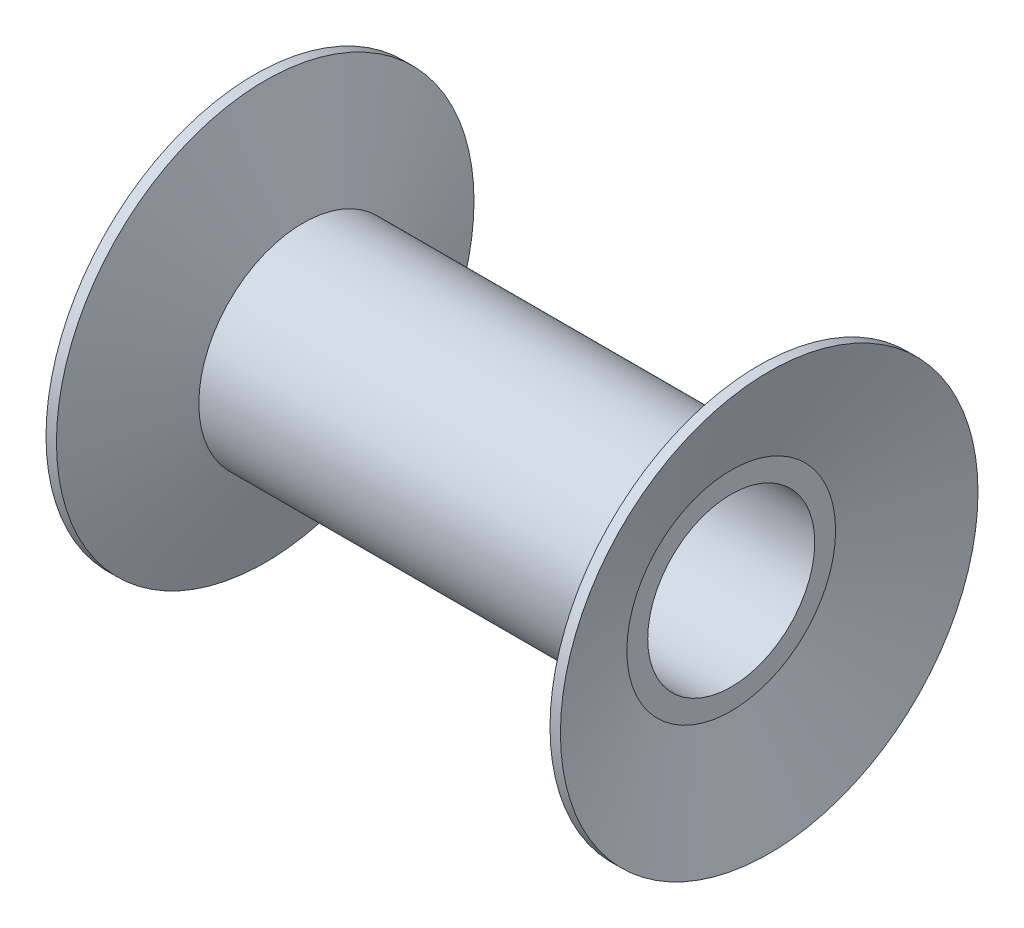
ISO-10303-21;
HEADER;
FILE_DESCRIPTION(('STEP AP214'),'2;1');
FILE_NAME('part.step','',(''),(''),'','','');
FILE_SCHEMA(('AUTOMOTIVE_DESIGN { 1 0 10303 214 1 1 1 1 }'));
ENDSEC;
DATA;
#1=APPLICATION_CONTEXT('core data for automotive mechanical design processes');
#2=APPLICATION_PROTOCOL_DEFINITION('international standard','automotive_design',2000,#1);
#3=PRODUCT_CONTEXT('',#1,'mechanical');
#4=PRODUCT('Part','Part','',(#3));
#5=PRODUCT_RELATED_PRODUCT_CATEGORY('part','',(#4));
#6=PRODUCT_DEFINITION_FORMATION('','',#4);
#7=PRODUCT_DEFINITION_CONTEXT('part definition',#1,'design');
#8=PRODUCT_DEFINITION('design','',#6,#7);
#9=PRODUCT_DEFINITION_SHAPE('','',#8);
#10=(LENGTH_UNIT() NAMED_UNIT(*) SI_UNIT(.MILLI.,.METRE.));
#11=(NAMED_UNIT(*) PLANE_ANGLE_UNIT() SI_UNIT($,.RADIAN.));
#12=(NAMED_UNIT(*) SI_UNIT($,.STERADIAN.) SOLID_ANGLE_UNIT());
#13=UNCERTAINTY_MEASURE_WITH_UNIT(LENGTH_MEASURE(1.E-05),#10,'distance_accuracy_value','');
#14=(GEOMETRIC_REPRESENTATION_CONTEXT(3) GLOBAL_UNCERTAINTY_ASSIGNED_CONTEXT((#13)) GLOBAL_UNIT_ASSIGNED_CONTEXT((#10,
#11,#12)) REPRESENTATION_CONTEXT('',''));
#15=CARTESIAN_POINT('',(0.,0.,0.));
#16=DIRECTION('',(0.,0.,1.));
#17=DIRECTION('',(1.,0.,0.));
#18=AXIS2_PLACEMENT_3D('',#15,#16,#17);
#19=CARTESIAN_POINT('',(118.19851171331,0.,0.));
#20=DIRECTION('',(1.,0.,0.));
#21=DIRECTION('',(0.,0.,-1.));
#22=AXIS2_PLACEMENT_3D('',#19,#20,#21);
#23=CONICAL_SURFACE('',#22,100.,1.22173047639603);
#24=CARTESIAN_POINT('',(100.,0.,0.));
#25=DIRECTION('',(1.,0.,0.));
#26=DIRECTION('',(0.,0.,-1.));
#27=AXIS2_PLACEMENT_3D('',#24,#25,#26);
#28=CIRCLE('',#27,50.);
#29=CARTESIAN_POINT('',(100.,0.,-50.));
#30=VERTEX_POINT('',#29);
#31=EDGE_CURVE('E59',#30,#30,#28,.T.);
#32=ORIENTED_EDGE('',*,*,#31,.T.);
#33=EDGE_LOOP('',(#32));
#34=FACE_BOUND('',#33,.T.);
#35=CARTESIAN_POINT('',(118.19851171331,0.,0.));
#36=DIRECTION('',(1.,0.,0.));
#37=DIRECTION('',(0.,0.,-1.));
#38=AXIS2_PLACEMENT_3D('',#35,#36,#37);
#39=CIRCLE('',#38,100.);
#40=CARTESIAN_POINT('',(118.19851171331,0.,-100.));
#41=VERTEX_POINT('',#40);
#42=EDGE_CURVE('E10',#41,#41,#39,.T.);
#43=ORIENTED_EDGE('',*,*,#42,.F.);
#44=EDGE_LOOP('',(#43));
#45=FACE_BOUND('',#44,.T.);
#46=ADVANCED_FACE('F31',(#34,#45),#23,.T.);
#47=CARTESIAN_POINT('',(160.387463578635,0.,0.));
#48=DIRECTION('',(1.,0.,0.));
#49=DIRECTION('',(0.,0.,-1.));
#50=AXIS2_PLACEMENT_3D('',#47,#48,#49);
#51=CYLINDRICAL_SURFACE('',#50,100.);
#52=ORIENTED_EDGE('',*,*,#42,.T.);
#53=EDGE_LOOP('',(#52));
#54=FACE_BOUND('',#53,.T.);
#55=CARTESIAN_POINT('',(123.19851171331,0.,0.));
#56=DIRECTION('',(1.,0.,0.));
#57=DIRECTION('',(0.,0.,-1.));
#58=AXIS2_PLACEMENT_3D('',#55,#56,#57);
#59=CIRCLE('',#58,100.);
#60=CARTESIAN_POINT('',(123.19851171331,0.,-100.));
#61=VERTEX_POINT('',#60);
#62=EDGE_CURVE('E38',#61,#61,#59,.T.);
#63=ORIENTED_EDGE('',*,*,#62,.F.);
#64=EDGE_LOOP('',(#63));
#65=FACE_BOUND('',#64,.T.);
#66=ADVANCED_FACE('F104',(#54,#65),#51,.T.);
#67=CARTESIAN_POINT('',(105.,0.,0.));
#68=DIRECTION('',(1.,0.,0.));
#69=DIRECTION('',(0.,0.,-1.));
#70=AXIS2_PLACEMENT_3D('',#67,#68,#69);
#71=CONICAL_SURFACE('',#70,50.,1.22173047639603);
#72=ORIENTED_EDGE('',*,*,#62,.T.);
#73=EDGE_LOOP('',(#72));
#74=FACE_BOUND('',#73,.T.);
#75=CARTESIAN_POINT('',(105.,0.,0.));
#76=DIRECTION('',(1.,0.,0.));
#77=DIRECTION('',(0.,0.,-1.));
#78=AXIS2_PLACEMENT_3D('',#75,#76,#77);
#79=CIRCLE('',#78,50.);
#80=CARTESIAN_POINT('',(105.,0.,-50.));
#81=VERTEX_POINT('',#80);
#82=EDGE_CURVE('E42',#81,#81,#79,.T.);
#83=ORIENTED_EDGE('',*,*,#82,.F.);
#84=EDGE_LOOP('',(#83));
#85=FACE_BOUND('',#84,.T.);
#86=ADVANCED_FACE('F108',(#74,#85),#71,.F.);
#87=CARTESIAN_POINT('',(105.,50.,0.));
#88=DIRECTION('',(1.,0.,0.));
#89=DIRECTION('',(0.,0.,-1.));
#90=AXIS2_PLACEMENT_3D('',#87,#88,#89);
#91=PLANE('',#90);
#92=CARTESIAN_POINT('',(105.,0.,0.));
#93=DIRECTION('',(1.,0.,0.));
#94=DIRECTION('',(0.,0.,-1.));
#95=AXIS2_PLACEMENT_3D('',#92,#93,#94);
#96=CIRCLE('',#95,40.);
#97=CARTESIAN_POINT('',(105.,0.,-40.));
#98=VERTEX_POINT('',#97);
#99=EDGE_CURVE('E62',#98,#98,#96,.T.);
#100=ORIENTED_EDGE('',*,*,#99,.F.);
#101=EDGE_LOOP('',(#100));
#102=FACE_BOUND('',#101,.T.);
#103=ORIENTED_EDGE('',*,*,#82,.T.);
#104=EDGE_LOOP('',(#103));
#105=FACE_BOUND('',#104,.T.);
#106=ADVANCED_FACE('F75',(#102,#105),#91,.T.);
#107=CARTESIAN_POINT('',(-105.,50.,0.));
#108=DIRECTION('',(-1.,0.,0.));
#109=DIRECTION('',(0.,0.,1.));
#110=AXIS2_PLACEMENT_3D('',#107,#108,#109);
#111=PLANE('',#110);
#112=CARTESIAN_POINT('',(-105.,0.,0.));
#113=DIRECTION('',(-1.,0.,0.));
#114=DIRECTION('',(0.,0.,1.));
#115=AXIS2_PLACEMENT_3D('',#112,#113,#114);
#116=CIRCLE('',#115,40.);
#117=CARTESIAN_POINT('',(-105.,0.,40.));
#118=VERTEX_POINT('',#117);
#119=EDGE_CURVE('E34',#118,#118,#116,.T.);
#120=ORIENTED_EDGE('',*,*,#119,.F.);
#121=EDGE_LOOP('',(#120));
#122=FACE_BOUND('',#121,.T.);
#123=CARTESIAN_POINT('',(-105.,0.,0.));
#124=DIRECTION('',(1.,0.,0.));
#125=DIRECTION('',(0.,0.,-1.));
#126=AXIS2_PLACEMENT_3D('',#123,#124,#125);
#127=CIRCLE('',#126,50.);
#128=CARTESIAN_POINT('',(-105.,0.,-50.));
#129=VERTEX_POINT('',#128);
#130=EDGE_CURVE('E47',#129,#129,#127,.T.);
#131=ORIENTED_EDGE('',*,*,#130,.F.);
#132=EDGE_LOOP('',(#131));
#133=FACE_BOUND('',#132,.T.);
#134=ADVANCED_FACE('F71',(#122,#133),#111,.T.);
#135=CARTESIAN_POINT('',(-123.19851171331,0.,0.));
#136=DIRECTION('',(-1.,0.,0.));
#137=DIRECTION('',(0.,0.,1.));
#138=AXIS2_PLACEMENT_3D('',#135,#136,#137);
#139=CONICAL_SURFACE('',#138,100.,1.22173047639603);
#140=ORIENTED_EDGE('',*,*,#130,.T.);
#141=EDGE_LOOP('',(#140));
#142=FACE_BOUND('',#141,.T.);
#143=CARTESIAN_POINT('',(-123.19851171331,0.,0.));
#144=DIRECTION('',(1.,0.,0.));
#145=DIRECTION('',(0.,0.,-1.));
#146=AXIS2_PLACEMENT_3D('',#143,#144,#145);
#147=CIRCLE('',#146,100.);
#148=CARTESIAN_POINT('',(-123.19851171331,0.,-100.));
#149=VERTEX_POINT('',#148);
#150=EDGE_CURVE('E50',#149,#149,#147,.T.);
#151=ORIENTED_EDGE('',*,*,#150,.F.);
#152=EDGE_LOOP('',(#151));
#153=FACE_BOUND('',#152,.T.);
#154=ADVANCED_FACE('F74',(#142,#153),#139,.F.);
#155=CARTESIAN_POINT('',(160.387463578635,0.,0.));
#156=DIRECTION('',(1.,0.,0.));
#157=DIRECTION('',(0.,0.,-1.));
#158=AXIS2_PLACEMENT_3D('',#155,#156,#157);
#159=CYLINDRICAL_SURFACE('',#158,100.);
#160=ORIENTED_EDGE('',*,*,#150,.T.);
#161=EDGE_LOOP('',(#160));
#162=FACE_BOUND('',#161,.T.);
#163=CARTESIAN_POINT('',(-118.19851171331,0.,0.));
#164=DIRECTION('',(1.,0.,0.));
#165=DIRECTION('',(0.,0.,-1.));
#166=AXIS2_PLACEMENT_3D('',#163,#164,#165);
#167=CIRCLE('',#166,100.);
#168=CARTESIAN_POINT('',(-118.19851171331,0.,-100.));
#169=VERTEX_POINT('',#168);
#170=EDGE_CURVE('E53',#169,#169,#167,.T.);
#171=ORIENTED_EDGE('',*,*,#170,.F.);
#172=EDGE_LOOP('',(#171));
#173=FACE_BOUND('',#172,.T.);
#174=ADVANCED_FACE('F81',(#162,#173),#159,.T.);
#175=CARTESIAN_POINT('',(-100.,0.,0.));
#176=DIRECTION('',(-1.,0.,0.));
#177=DIRECTION('',(0.,0.,1.));
#178=AXIS2_PLACEMENT_3D('',#175,#176,#177);
#179=CONICAL_SURFACE('',#178,50.,1.22173047639603);
#180=ORIENTED_EDGE('',*,*,#170,.T.);
#181=EDGE_LOOP('',(#180));
#182=FACE_BOUND('',#181,.T.);
#183=CARTESIAN_POINT('',(-100.,0.,0.));
#184=DIRECTION('',(1.,0.,0.));
#185=DIRECTION('',(0.,0.,-1.));
#186=AXIS2_PLACEMENT_3D('',#183,#184,#185);
#187=CIRCLE('',#186,50.);
#188=CARTESIAN_POINT('',(-100.,0.,-50.));
#189=VERTEX_POINT('',#188);
#190=EDGE_CURVE('E56',#189,#189,#187,.T.);
#191=ORIENTED_EDGE('',*,*,#190,.F.);
#192=EDGE_LOOP('',(#191));
#193=FACE_BOUND('',#192,.T.);
#194=ADVANCED_FACE('F87',(#182,#193),#179,.T.);
#195=CARTESIAN_POINT('',(160.387463578635,0.,0.));
#196=DIRECTION('',(1.,0.,0.));
#197=DIRECTION('',(0.,0.,-1.));
#198=AXIS2_PLACEMENT_3D('',#195,#196,#197);
#199=CYLINDRICAL_SURFACE('',#198,50.);
#200=ORIENTED_EDGE('',*,*,#190,.T.);
#201=EDGE_LOOP('',(#200));
#202=FACE_BOUND('',#201,.T.);
#203=ORIENTED_EDGE('',*,*,#31,.F.);
#204=EDGE_LOOP('',(#203));
#205=FACE_BOUND('',#204,.T.);
#206=ADVANCED_FACE('F93',(#202,#205),#199,.T.);
#207=CARTESIAN_POINT('',(-123.19851171331,0.,0.));
#208=DIRECTION('',(1.,0.,0.));
#209=DIRECTION('',(0.,0.,-1.));
#210=AXIS2_PLACEMENT_3D('',#207,#208,#209);
#211=CYLINDRICAL_SURFACE('',#210,40.);
#212=ORIENTED_EDGE('',*,*,#99,.T.);
#213=EDGE_LOOP('',(#212));
#214=FACE_BOUND('',#213,.T.);
#215=ORIENTED_EDGE('',*,*,#119,.T.);
#216=EDGE_LOOP('',(#215));
#217=FACE_BOUND('',#216,.T.);
#218=ADVANCED_FACE('F69',(#214,#217),#211,.F.);
#219=CLOSED_SHELL('',(#46,#66,#86,#106,#134,#154,#174,#194,#206,#218));
#220=MANIFOLD_SOLID_BREP('B2',#219);
#221=ADVANCED_BREP_SHAPE_REPRESENTATION('',(#18,#220),#14);
#222=SHAPE_DEFINITION_REPRESENTATION(#9,#221);
ENDSEC;
END-ISO-10303-21;
